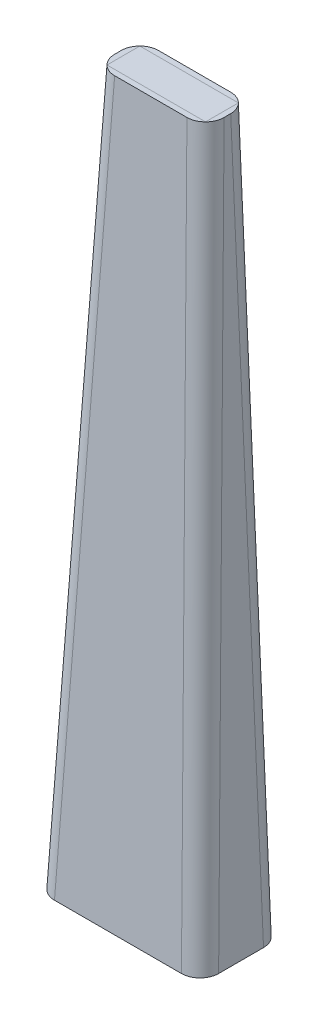
ISO-10303-21;
HEADER;
FILE_DESCRIPTION(('STEP AP214'),'2;1');
FILE_NAME('part.step','',(''),(''),'','','');
FILE_SCHEMA(('AUTOMOTIVE_DESIGN { 1 0 10303 214 1 1 1 1 }'));
ENDSEC;
DATA;
#1=APPLICATION_CONTEXT('core data for automotive mechanical design processes');
#2=APPLICATION_PROTOCOL_DEFINITION('international standard','automotive_design',2000,#1);
#3=PRODUCT_CONTEXT('',#1,'mechanical');
#4=PRODUCT('Part','Part','',(#3));
#5=PRODUCT_RELATED_PRODUCT_CATEGORY('part','',(#4));
#6=PRODUCT_DEFINITION_FORMATION('','',#4);
#7=PRODUCT_DEFINITION_CONTEXT('part definition',#1,'design');
#8=PRODUCT_DEFINITION('design','',#6,#7);
#9=PRODUCT_DEFINITION_SHAPE('','',#8);
#10=(LENGTH_UNIT() NAMED_UNIT(*) SI_UNIT(.MILLI.,.METRE.));
#11=(NAMED_UNIT(*) PLANE_ANGLE_UNIT() SI_UNIT($,.RADIAN.));
#12=(NAMED_UNIT(*) SI_UNIT($,.STERADIAN.) SOLID_ANGLE_UNIT());
#13=UNCERTAINTY_MEASURE_WITH_UNIT(LENGTH_MEASURE(1.E-05),#10,'distance_accuracy_value','');
#14=(GEOMETRIC_REPRESENTATION_CONTEXT(3) GLOBAL_UNCERTAINTY_ASSIGNED_CONTEXT((#13)) GLOBAL_UNIT_ASSIGNED_CONTEXT((#10,
#11,#12)) REPRESENTATION_CONTEXT('',''));
#15=CARTESIAN_POINT('',(0.,0.,0.));
#16=DIRECTION('',(0.,0.,1.));
#17=DIRECTION('',(1.,0.,0.));
#18=AXIS2_PLACEMENT_3D('',#15,#16,#17);
#19=CARTESIAN_POINT('',(-45.,640.,2.50000000000001));
#20=DIRECTION('',(0.,0.,1.));
#21=DIRECTION('',(1.,0.,0.));
#22=AXIS2_PLACEMENT_3D('',#19,#20,#21);
#23=PLANE('',#22);
#24=DIRECTION('',(1.,0.,0.));
#25=VECTOR('',#24,1.);
#26=CARTESIAN_POINT('',(-45.,650.,2.50000000000001));
#27=LINE('',#26,#25);
#28=CARTESIAN_POINT('',(-45.,650.,2.50000000000001));
#29=VERTEX_POINT('',#28);
#30=CARTESIAN_POINT('',(45.,650.,2.50000000000001));
#31=VERTEX_POINT('',#30);
#32=EDGE_CURVE('E256',#29,#31,#27,.T.);
#33=ORIENTED_EDGE('',*,*,#32,.F.);
#34=DIRECTION('',(0.,1.,0.));
#35=VECTOR('',#34,1.);
#36=CARTESIAN_POINT('',(-45.,640.,2.50000000000001));
#37=LINE('',#36,#35);
#38=CARTESIAN_POINT('',(-45.,640.,2.50000000000001));
#39=VERTEX_POINT('',#38);
#40=EDGE_CURVE('E14',#39,#29,#37,.T.);
#41=ORIENTED_EDGE('',*,*,#40,.F.);
#42=DIRECTION('',(1.,0.,0.));
#43=VECTOR('',#42,1.);
#44=CARTESIAN_POINT('',(-45.,640.,2.50000000000001));
#45=LINE('',#44,#43);
#46=CARTESIAN_POINT('',(45.,640.,2.50000000000001));
#47=VERTEX_POINT('',#46);
#48=EDGE_CURVE('E250',#39,#47,#45,.T.);
#49=ORIENTED_EDGE('',*,*,#48,.T.);
#50=DIRECTION('',(0.,1.,0.));
#51=VECTOR('',#50,1.);
#52=CARTESIAN_POINT('',(45.,640.,2.50000000000001));
#53=LINE('',#52,#51);
#54=EDGE_CURVE('E195',#47,#31,#53,.T.);
#55=ORIENTED_EDGE('',*,*,#54,.T.);
#56=EDGE_LOOP('',(#33,#41,#49,#55));
#57=FACE_BOUND('',#56,.T.);
#58=ADVANCED_FACE('F192',(#57),#23,.T.);
#59=CARTESIAN_POINT('',(-45.,640.,-27.5));
#60=DIRECTION('',(-1.,0.,0.));
#61=DIRECTION('',(0.,0.,1.));
#62=AXIS2_PLACEMENT_3D('',#59,#60,#61);
#63=PLANE('',#62);
#64=DIRECTION('',(0.,0.,1.));
#65=VECTOR('',#64,1.);
#66=CARTESIAN_POINT('',(-45.,650.,-27.5));
#67=LINE('',#66,#65);
#68=CARTESIAN_POINT('',(-45.,650.,-27.5));
#69=VERTEX_POINT('',#68);
#70=EDGE_CURVE('E252',#69,#29,#67,.T.);
#71=ORIENTED_EDGE('',*,*,#70,.F.);
#72=DIRECTION('',(0.,1.,0.));
#73=VECTOR('',#72,1.);
#74=CARTESIAN_POINT('',(-45.,640.,-27.5));
#75=LINE('',#74,#73);
#76=CARTESIAN_POINT('',(-45.,640.,-27.5));
#77=VERTEX_POINT('',#76);
#78=EDGE_CURVE('E201',#77,#69,#75,.T.);
#79=ORIENTED_EDGE('',*,*,#78,.F.);
#80=DIRECTION('',(0.,0.,1.));
#81=VECTOR('',#80,1.);
#82=CARTESIAN_POINT('',(-45.,640.,-27.5));
#83=LINE('',#82,#81);
#84=EDGE_CURVE('E247',#77,#39,#83,.T.);
#85=ORIENTED_EDGE('',*,*,#84,.T.);
#86=ORIENTED_EDGE('',*,*,#40,.T.);
#87=EDGE_LOOP('',(#71,#79,#85,#86));
#88=FACE_BOUND('',#87,.T.);
#89=ADVANCED_FACE('F266',(#88),#63,.T.);
#90=CARTESIAN_POINT('',(0.,640.,-27.5));
#91=DIRECTION('',(0.,0.,-1.));
#92=DIRECTION('',(-1.,0.,0.));
#93=AXIS2_PLACEMENT_3D('',#90,#91,#92);
#94=PLANE('',#93);
#95=DIRECTION('',(-1.,0.,0.));
#96=VECTOR('',#95,1.);
#97=CARTESIAN_POINT('',(0.,650.,-27.5));
#98=LINE('',#97,#96);
#99=CARTESIAN_POINT('',(45.,650.,-27.5));
#100=VERTEX_POINT('',#99);
#101=EDGE_CURVE('E241',#100,#69,#98,.T.);
#102=ORIENTED_EDGE('',*,*,#101,.F.);
#103=DIRECTION('',(0.,1.,0.));
#104=VECTOR('',#103,1.);
#105=CARTESIAN_POINT('',(45.,640.,-27.5));
#106=LINE('',#105,#104);
#107=CARTESIAN_POINT('',(45.,640.,-27.5));
#108=VERTEX_POINT('',#107);
#109=EDGE_CURVE('E237',#108,#100,#106,.T.);
#110=ORIENTED_EDGE('',*,*,#109,.F.);
#111=DIRECTION('',(-1.,0.,0.));
#112=VECTOR('',#111,1.);
#113=CARTESIAN_POINT('',(45.,640.,-27.5));
#114=LINE('',#113,#112);
#115=EDGE_CURVE('E240',#108,#77,#114,.T.);
#116=ORIENTED_EDGE('',*,*,#115,.T.);
#117=ORIENTED_EDGE('',*,*,#78,.T.);
#118=EDGE_LOOP('',(#102,#110,#116,#117));
#119=FACE_BOUND('',#118,.T.);
#120=ADVANCED_FACE('F239',(#119),#94,.T.);
#121=CARTESIAN_POINT('',(45.,640.,2.50000000000001));
#122=DIRECTION('',(1.,0.,0.));
#123=DIRECTION('',(0.,0.,-1.));
#124=AXIS2_PLACEMENT_3D('',#121,#122,#123);
#125=PLANE('',#124);
#126=DIRECTION('',(0.,0.,-1.));
#127=VECTOR('',#126,1.);
#128=CARTESIAN_POINT('',(45.,650.,2.50000000000001));
#129=LINE('',#128,#127);
#130=EDGE_CURVE('E259',#31,#100,#129,.T.);
#131=ORIENTED_EDGE('',*,*,#130,.F.);
#132=ORIENTED_EDGE('',*,*,#54,.F.);
#133=DIRECTION('',(0.,0.,-1.));
#134=VECTOR('',#133,1.);
#135=CARTESIAN_POINT('',(45.,640.,2.50000000000001));
#136=LINE('',#135,#134);
#137=EDGE_CURVE('E246',#47,#108,#136,.T.);
#138=ORIENTED_EDGE('',*,*,#137,.T.);
#139=ORIENTED_EDGE('',*,*,#109,.T.);
#140=EDGE_LOOP('',(#131,#132,#138,#139));
#141=FACE_BOUND('',#140,.T.);
#142=ADVANCED_FACE('F249',(#141),#125,.T.);
#143=CARTESIAN_POINT('',(0.,640.,0.));
#144=DIRECTION('',(0.,1.,0.));
#145=DIRECTION('',(0.,0.,1.));
#146=AXIS2_PLACEMENT_3D('',#143,#144,#145);
#147=PLANE('',#146);
#148=ORIENTED_EDGE('',*,*,#48,.F.);
#149=ORIENTED_EDGE('',*,*,#84,.F.);
#150=ORIENTED_EDGE('',*,*,#115,.F.);
#151=ORIENTED_EDGE('',*,*,#137,.F.);
#152=EDGE_LOOP('',(#148,#149,#150,#151));
#153=FACE_BOUND('',#152,.T.);
#154=ADVANCED_FACE('F245',(#153),#147,.F.);
#155=CARTESIAN_POINT('',(0.,650.,0.));
#156=DIRECTION('',(0.,1.,0.));
#157=DIRECTION('',(0.,0.,1.));
#158=AXIS2_PLACEMENT_3D('',#155,#156,#157);
#159=PLANE('',#158);
#160=ORIENTED_EDGE('',*,*,#32,.T.);
#161=ORIENTED_EDGE('',*,*,#130,.T.);
#162=ORIENTED_EDGE('',*,*,#101,.T.);
#163=ORIENTED_EDGE('',*,*,#70,.T.);
#164=EDGE_LOOP('',(#160,#161,#162,#163));
#165=FACE_BOUND('',#164,.T.);
#166=ADVANCED_FACE('F265',(#165),#159,.T.);
#167=CLOSED_SHELL('',(#58,#89,#120,#142,#154,#166));
#168=MANIFOLD_SOLID_BREP('B2',#167);
#169=CARTESIAN_POINT('',(-67.5,0.,-30.));
#170=DIRECTION('',(-0.999401425440469,0.0345946647267855,0.));
#171=DIRECTION('',(0.,0.,1.));
#172=AXIS2_PLACEMENT_3D('',#169,#170,#171);
#173=PLANE('',#172);
#174=DIRECTION('',(0.,0.,1.));
#175=VECTOR('',#174,1.);
#176=CARTESIAN_POINT('',(-67.1538461538462,10.,-30.));
#177=LINE('',#176,#175);
#178=CARTESIAN_POINT('',(-67.1538461538462,10.,-29.9615384615385));
#179=VERTEX_POINT('',#178);
#180=CARTESIAN_POINT('',(-67.1538461538462,10.,29.5769230769231));
#181=VERTEX_POINT('',#180);
#182=EDGE_CURVE('E426',#179,#181,#177,.T.);
#183=ORIENTED_EDGE('',*,*,#182,.F.);
#184=CARTESIAN_POINT('',(-67.5,0.,-30.));
#185=CARTESIAN_POINT('',(-60.,216.666666666667,-29.1666666666667));
#186=CARTESIAN_POINT('',(-52.5,433.333333333333,-28.3333333333333));
#187=CARTESIAN_POINT('',(-45.,650.,-27.5));
#188=B_SPLINE_CURVE_WITH_KNOTS('',3,(#184,#185,#186,#187),.UNSPECIFIED.,.F.,.F.,(4,4),(0.,1.),.UNSPECIFIED.);
#189=CARTESIAN_POINT('',(-45.,650.,-27.5));
#190=VERTEX_POINT('',#189);
#191=EDGE_CURVE('E450',#179,#190,#188,.T.);
#192=ORIENTED_EDGE('',*,*,#191,.T.);
#193=DIRECTION('',(0.,0.,1.));
#194=VECTOR('',#193,1.);
#195=CARTESIAN_POINT('',(-45.,650.,-27.5));
#196=LINE('',#195,#194);
#197=CARTESIAN_POINT('',(-45.,650.,2.50000000000001));
#198=VERTEX_POINT('',#197);
#199=EDGE_CURVE('E482',#190,#198,#196,.T.);
#200=ORIENTED_EDGE('',*,*,#199,.T.);
#201=CARTESIAN_POINT('',(-67.5,0.,30.));
#202=CARTESIAN_POINT('',(-60.,216.666666666667,20.8333333333333));
#203=CARTESIAN_POINT('',(-52.5,433.333333333333,11.6666666666667));
#204=CARTESIAN_POINT('',(-45.,650.,2.50000000000001));
#205=B_SPLINE_CURVE_WITH_KNOTS('',3,(#201,#202,#203,#204),.UNSPECIFIED.,.F.,.F.,(4,4),(0.,1.),.UNSPECIFIED.);
#206=EDGE_CURVE('E478',#181,#198,#205,.T.);
#207=ORIENTED_EDGE('',*,*,#206,.F.);
#208=EDGE_LOOP('',(#183,#192,#200,#207));
#209=FACE_BOUND('',#208,.T.);
#210=ADVANCED_FACE('F319',(#209),#173,.F.);
#211=CARTESIAN_POINT('',(67.5,0.,-30.));
#212=DIRECTION('',(0.,0.00384612539858595,-0.999992603632356));
#213=DIRECTION('',(-1.,0.,0.));
#214=AXIS2_PLACEMENT_3D('',#211,#212,#213);
#215=PLANE('',#214);
#216=DIRECTION('',(-1.,0.,0.));
#217=VECTOR('',#216,1.);
#218=CARTESIAN_POINT('',(67.5,10.,-29.9615384615384));
#219=LINE('',#218,#217);
#220=CARTESIAN_POINT('',(67.1538461538462,10.,-29.9615384615384));
#221=VERTEX_POINT('',#220);
#222=EDGE_CURVE('E434',#221,#179,#219,.T.);
#223=ORIENTED_EDGE('',*,*,#222,.F.);
#224=CARTESIAN_POINT('',(67.5,0.,-30.));
#225=CARTESIAN_POINT('',(60.,216.666666666667,-29.1666666666667));
#226=CARTESIAN_POINT('',(52.5,433.333333333333,-28.3333333333333));
#227=CARTESIAN_POINT('',(45.,650.,-27.5));
#228=B_SPLINE_CURVE_WITH_KNOTS('',3,(#224,#225,#226,#227),.UNSPECIFIED.,.F.,.F.,(4,4),(0.,1.),.UNSPECIFIED.);
#229=CARTESIAN_POINT('',(45.,650.,-27.5));
#230=VERTEX_POINT('',#229);
#231=EDGE_CURVE('E425',#221,#230,#228,.T.);
#232=ORIENTED_EDGE('',*,*,#231,.T.);
#233=DIRECTION('',(-1.,0.,0.));
#234=VECTOR('',#233,1.);
#235=CARTESIAN_POINT('',(45.,650.,-27.5));
#236=LINE('',#235,#234);
#237=EDGE_CURVE('E486',#230,#190,#236,.T.);
#238=ORIENTED_EDGE('',*,*,#237,.T.);
#239=ORIENTED_EDGE('',*,*,#191,.F.);
#240=EDGE_LOOP('',(#223,#232,#238,#239));
#241=FACE_BOUND('',#240,.T.);
#242=ADVANCED_FACE('F536',(#241),#215,.F.);
#243=CARTESIAN_POINT('',(67.5,0.,30.));
#244=DIRECTION('',(0.999401425440469,0.0345946647267855,0.));
#245=DIRECTION('',(0.,0.,-1.));
#246=AXIS2_PLACEMENT_3D('',#243,#244,#245);
#247=PLANE('',#246);
#248=DIRECTION('',(0.,0.,-1.));
#249=VECTOR('',#248,1.);
#250=CARTESIAN_POINT('',(67.1538461538462,10.,30.));
#251=LINE('',#250,#249);
#252=CARTESIAN_POINT('',(67.1538461538462,10.,29.5769230769231));
#253=VERTEX_POINT('',#252);
#254=EDGE_CURVE('E430',#253,#221,#251,.T.);
#255=ORIENTED_EDGE('',*,*,#254,.F.);
#256=CARTESIAN_POINT('',(67.5,0.,30.));
#257=CARTESIAN_POINT('',(60.,216.666666666667,20.8333333333334));
#258=CARTESIAN_POINT('',(52.5,433.333333333333,11.6666666666667));
#259=CARTESIAN_POINT('',(45.,650.,2.50000000000001));
#260=B_SPLINE_CURVE_WITH_KNOTS('',3,(#256,#257,#258,#259),.UNSPECIFIED.,.F.,.F.,(4,4),(0.,1.),.UNSPECIFIED.);
#261=CARTESIAN_POINT('',(45.,650.,2.50000000000001));
#262=VERTEX_POINT('',#261);
#263=EDGE_CURVE('E414',#253,#262,#260,.T.);
#264=ORIENTED_EDGE('',*,*,#263,.T.);
#265=DIRECTION('',(0.,0.,-1.));
#266=VECTOR('',#265,1.);
#267=CARTESIAN_POINT('',(45.,650.,2.50000000000001));
#268=LINE('',#267,#266);
#269=EDGE_CURVE('E491',#262,#230,#268,.T.);
#270=ORIENTED_EDGE('',*,*,#269,.T.);
#271=ORIENTED_EDGE('',*,*,#231,.F.);
#272=EDGE_LOOP('',(#255,#264,#270,#271));
#273=FACE_BOUND('',#272,.T.);
#274=ADVANCED_FACE('F431',(#273),#247,.F.);
#275=CARTESIAN_POINT('',(-67.5,0.,30.));
#276=DIRECTION('',(0.,0.0422698789300001,0.999106229254549));
#277=DIRECTION('',(1.,0.,0.));
#278=AXIS2_PLACEMENT_3D('',#275,#276,#277);
#279=PLANE('',#278);
#280=DIRECTION('',(1.,0.,0.));
#281=VECTOR('',#280,1.);
#282=CARTESIAN_POINT('',(-67.5,10.,29.5769230769231));
#283=LINE('',#282,#281);
#284=EDGE_CURVE('E418',#181,#253,#283,.T.);
#285=ORIENTED_EDGE('',*,*,#284,.F.);
#286=ORIENTED_EDGE('',*,*,#206,.T.);
#287=DIRECTION('',(1.,0.,0.));
#288=VECTOR('',#287,1.);
#289=CARTESIAN_POINT('',(-45.,650.,2.50000000000001));
#290=LINE('',#289,#288);
#291=EDGE_CURVE('E421',#198,#262,#290,.T.);
#292=ORIENTED_EDGE('',*,*,#291,.T.);
#293=ORIENTED_EDGE('',*,*,#263,.F.);
#294=EDGE_LOOP('',(#285,#286,#292,#293));
#295=FACE_BOUND('',#294,.T.);
#296=ADVANCED_FACE('F416',(#295),#279,.F.);
#297=CARTESIAN_POINT('',(0.,650.,0.));
#298=DIRECTION('',(0.,1.,0.));
#299=DIRECTION('',(0.,0.,1.));
#300=AXIS2_PLACEMENT_3D('',#297,#298,#299);
#301=PLANE('',#300);
#302=ORIENTED_EDGE('',*,*,#199,.F.);
#303=ORIENTED_EDGE('',*,*,#237,.F.);
#304=ORIENTED_EDGE('',*,*,#269,.F.);
#305=ORIENTED_EDGE('',*,*,#291,.F.);
#306=EDGE_LOOP('',(#302,#303,#304,#305));
#307=FACE_BOUND('',#306,.T.);
#308=DIRECTION('',(1.,0.,0.));
#309=VECTOR('',#308,1.);
#310=CARTESIAN_POINT('',(-50.,650.,7.50000000000001));
#311=LINE('',#310,#309);
#312=CARTESIAN_POINT('',(-33.0175761065224,650.,7.50000000000001));
#313=VERTEX_POINT('',#312);
#314=CARTESIAN_POINT('',(33.0175761065224,650.,7.50000000000001));
#315=VERTEX_POINT('',#314);
#316=EDGE_CURVE('E619',#313,#315,#311,.T.);
#317=ORIENTED_EDGE('',*,*,#316,.T.);
#318=CARTESIAN_POINT('',(32.9874306822015,650.,-9.51809687661271));
#319=DIRECTION('',(0.,1.,0.));
#320=DIRECTION('',(-0.64018439966448,0.,-0.768221279597376));
#321=AXIS2_PLACEMENT_3D('',#318,#319,#320);
#322=ELLIPSE('',#321,17.0306528381819,17.);
#323=CARTESIAN_POINT('',(50.,650.,-9.48794165773331));
#324=VERTEX_POINT('',#323);
#325=EDGE_CURVE('E736',#315,#324,#322,.T.);
#326=ORIENTED_EDGE('',*,*,#325,.T.);
#327=DIRECTION('',(0.,0.,-1.));
#328=VECTOR('',#327,1.);
#329=CARTESIAN_POINT('',(50.,650.,7.50000000000001));
#330=LINE('',#329,#328);
#331=CARTESIAN_POINT('',(50.,650.,-15.5045229186733));
#332=VERTEX_POINT('',#331);
#333=EDGE_CURVE('E443',#324,#332,#330,.T.);
#334=ORIENTED_EDGE('',*,*,#333,.T.);
#335=CARTESIAN_POINT('',(32.9874306822015,650.,-15.4994970488601));
#336=DIRECTION('',(0.,1.,0.));
#337=DIRECTION('',(-0.98058067569092,0.,0.196116135138184));
#338=AXIS2_PLACEMENT_3D('',#335,#336,#337);
#339=ELLIPSE('',#338,17.0130718973563,17.);
#340=CARTESIAN_POINT('',(32.9924601192026,650.,-32.5));
#341=VERTEX_POINT('',#340);
#342=EDGE_CURVE('E653',#332,#341,#339,.T.);
#343=ORIENTED_EDGE('',*,*,#342,.T.);
#344=DIRECTION('',(-1.,0.,0.));
#345=VECTOR('',#344,1.);
#346=CARTESIAN_POINT('',(0.,650.,-32.5));
#347=LINE('',#346,#345);
#348=CARTESIAN_POINT('',(0.,650.,-32.5));
#349=VERTEX_POINT('',#348);
#350=EDGE_CURVE('E439',#341,#349,#347,.T.);
#351=ORIENTED_EDGE('',*,*,#350,.T.);
#352=DIRECTION('',(-1.,0.,0.));
#353=VECTOR('',#352,1.);
#354=CARTESIAN_POINT('',(0.,650.,-32.5));
#355=LINE('',#354,#353);
#356=CARTESIAN_POINT('',(-32.9924601192026,650.,-32.5));
#357=VERTEX_POINT('',#356);
#358=EDGE_CURVE('E672',#349,#357,#355,.T.);
#359=ORIENTED_EDGE('',*,*,#358,.T.);
#360=CARTESIAN_POINT('',(-32.9874306822015,650.,-15.4994970488601));
#361=DIRECTION('',(0.,1.,0.));
#362=DIRECTION('',(0.98058067569092,0.,0.196116135138184));
#363=AXIS2_PLACEMENT_3D('',#360,#361,#362);
#364=ELLIPSE('',#363,17.0130718973563,17.);
#365=CARTESIAN_POINT('',(-50.,650.,-15.5045229186733));
#366=VERTEX_POINT('',#365);
#367=EDGE_CURVE('E728',#357,#366,#364,.T.);
#368=ORIENTED_EDGE('',*,*,#367,.T.);
#369=DIRECTION('',(0.,0.,1.));
#370=VECTOR('',#369,1.);
#371=CARTESIAN_POINT('',(-50.,650.,-32.5));
#372=LINE('',#371,#370);
#373=CARTESIAN_POINT('',(-50.,650.,-9.4879416577333));
#374=VERTEX_POINT('',#373);
#375=EDGE_CURVE('E623',#366,#374,#372,.T.);
#376=ORIENTED_EDGE('',*,*,#375,.T.);
#377=CARTESIAN_POINT('',(-32.9874306822015,650.,-9.5180968766127));
#378=DIRECTION('',(0.,1.,0.));
#379=DIRECTION('',(0.640184399664479,0.,-0.768221279597376));
#380=AXIS2_PLACEMENT_3D('',#377,#378,#379);
#381=ELLIPSE('',#380,17.0306528381819,17.);
#382=EDGE_CURVE('E732',#374,#313,#381,.T.);
#383=ORIENTED_EDGE('',*,*,#382,.T.);
#384=EDGE_LOOP('',(#317,#326,#334,#343,#351,#359,#368,#376,#383));
#385=FACE_BOUND('',#384,.T.);
#386=ADVANCED_FACE('F550',(#307,#385),#301,.T.);
#387=CARTESIAN_POINT('',(0.,0.,0.));
#388=DIRECTION('',(0.,1.,0.));
#389=DIRECTION('',(0.,0.,1.));
#390=AXIS2_PLACEMENT_3D('',#387,#388,#389);
#391=PLANE('',#390);
#392=DIRECTION('',(0.,0.,-1.));
#393=VECTOR('',#392,1.);
#394=CARTESIAN_POINT('',(75.,0.,37.5));
#395=LINE('',#394,#393);
#396=CARTESIAN_POINT('',(75.,0.,20.5120583422667));
#397=VERTEX_POINT('',#396);
#398=CARTESIAN_POINT('',(75.,0.,-20.5045229186733));
#399=VERTEX_POINT('',#398);
#400=EDGE_CURVE('E323',#397,#399,#395,.T.);
#401=ORIENTED_EDGE('',*,*,#400,.F.);
#402=CARTESIAN_POINT('',(57.9874306822015,0.,20.4819031233873));
#403=DIRECTION('',(0.,1.,0.));
#404=DIRECTION('',(-0.64018439966448,0.,-0.768221279597376));
#405=AXIS2_PLACEMENT_3D('',#402,#403,#404);
#406=ELLIPSE('',#405,17.0306528381819,17.);
#407=CARTESIAN_POINT('',(58.0175761065224,0.,37.5));
#408=VERTEX_POINT('',#407);
#409=EDGE_CURVE('E599',#397,#408,#406,.F.);
#410=ORIENTED_EDGE('',*,*,#409,.T.);
#411=DIRECTION('',(1.,0.,0.));
#412=VECTOR('',#411,1.);
#413=CARTESIAN_POINT('',(75.,0.,37.5));
#414=LINE('',#413,#412);
#415=CARTESIAN_POINT('',(-58.0175761065224,0.,37.5));
#416=VERTEX_POINT('',#415);
#417=EDGE_CURVE('E624',#416,#408,#414,.T.);
#418=ORIENTED_EDGE('',*,*,#417,.F.);
#419=CARTESIAN_POINT('',(-57.9874306822015,0.,20.4819031233873));
#420=DIRECTION('',(0.,1.,0.));
#421=DIRECTION('',(0.640184399664479,0.,-0.768221279597376));
#422=AXIS2_PLACEMENT_3D('',#419,#420,#421);
#423=ELLIPSE('',#422,17.0306528381819,17.);
#424=CARTESIAN_POINT('',(-75.,0.,20.5120583422667));
#425=VERTEX_POINT('',#424);
#426=EDGE_CURVE('E595',#416,#425,#423,.F.);
#427=ORIENTED_EDGE('',*,*,#426,.T.);
#428=DIRECTION('',(0.,0.,1.));
#429=VECTOR('',#428,1.);
#430=CARTESIAN_POINT('',(-75.,0.,37.5));
#431=LINE('',#430,#429);
#432=CARTESIAN_POINT('',(-75.,0.,-20.5045229186733));
#433=VERTEX_POINT('',#432);
#434=EDGE_CURVE('E485',#433,#425,#431,.T.);
#435=ORIENTED_EDGE('',*,*,#434,.F.);
#436=CARTESIAN_POINT('',(-57.9874306822015,0.,-20.4994970488601));
#437=DIRECTION('',(0.,1.,0.));
#438=DIRECTION('',(0.98058067569092,0.,0.196116135138184));
#439=AXIS2_PLACEMENT_3D('',#436,#437,#438);
#440=ELLIPSE('',#439,17.0130718973563,17.);
#441=CARTESIAN_POINT('',(-57.9924601192026,0.,-37.5));
#442=VERTEX_POINT('',#441);
#443=EDGE_CURVE('E337',#433,#442,#440,.F.);
#444=ORIENTED_EDGE('',*,*,#443,.T.);
#445=DIRECTION('',(-1.,0.,0.));
#446=VECTOR('',#445,1.);
#447=CARTESIAN_POINT('',(75.,0.,-37.5));
#448=LINE('',#447,#446);
#449=CARTESIAN_POINT('',(57.9924601192026,0.,-37.5));
#450=VERTEX_POINT('',#449);
#451=EDGE_CURVE('E585',#450,#442,#448,.T.);
#452=ORIENTED_EDGE('',*,*,#451,.F.);
#453=CARTESIAN_POINT('',(57.9874306822015,0.,-20.4994970488601));
#454=DIRECTION('',(0.,1.,0.));
#455=DIRECTION('',(-0.98058067569092,0.,0.196116135138184));
#456=AXIS2_PLACEMENT_3D('',#453,#454,#455);
#457=ELLIPSE('',#456,17.0130718973563,17.);
#458=EDGE_CURVE('E589',#450,#399,#457,.F.);
#459=ORIENTED_EDGE('',*,*,#458,.T.);
#460=EDGE_LOOP('',(#401,#410,#418,#427,#435,#444,#452,#459));
#461=FACE_BOUND('',#460,.T.);
#462=ADVANCED_FACE('F551',(#461),#391,.F.);
#463=CARTESIAN_POINT('',(-75.,0.,-37.5));
#464=DIRECTION('',(-0.999261174631314,0.0384331221012044,0.));
#465=DIRECTION('',(0.,0.,1.));
#466=AXIS2_PLACEMENT_3D('',#463,#464,#465);
#467=PLANE('',#466);
#468=ORIENTED_EDGE('',*,*,#434,.T.);
#469=DIRECTION('',(0.0383923129699562,0.998200137218861,-0.0460707755639474));
#470=VECTOR('',#469,1.);
#471=CARTESIAN_POINT('',(-74.897390380858,2.66785009769283,20.3889267992963));
#472=LINE('',#471,#470);
#473=EDGE_CURVE('E607',#425,#374,#472,.T.);
#474=ORIENTED_EDGE('',*,*,#473,.T.);
#475=ORIENTED_EDGE('',*,*,#375,.F.);
#476=DIRECTION('',(0.0384319867564749,0.999231655668348,0.00768639735129497));
#477=VECTOR('',#476,1.);
#478=CARTESIAN_POINT('',(-75.0050205237744,-0.130533618136149,-20.5055270234282));
#479=LINE('',#478,#477);
#480=EDGE_CURVE('E603',#366,#433,#479,.F.);
#481=ORIENTED_EDGE('',*,*,#480,.T.);
#482=EDGE_LOOP('',(#468,#474,#475,#481));
#483=FACE_BOUND('',#482,.T.);
#484=ADVANCED_FACE('F555',(#483),#467,.T.);
#485=CARTESIAN_POINT('',(75.,0.,-37.5));
#486=DIRECTION('',(0.,0.0076920801193392,-0.999970415514098));
#487=DIRECTION('',(-1.,0.,0.));
#488=AXIS2_PLACEMENT_3D('',#485,#486,#487);
#489=PLANE('',#488);
#490=ORIENTED_EDGE('',*,*,#451,.T.);
#491=DIRECTION('',(0.0384319867564749,0.999231655668348,0.00768639735129497));
#492=VECTOR('',#491,1.);
#493=CARTESIAN_POINT('',(-57.7960279141347,5.10723733176661,-37.4607135589864));
#494=LINE('',#493,#492);
#495=EDGE_CURVE('E190',#442,#357,#494,.T.);
#496=ORIENTED_EDGE('',*,*,#495,.T.);
#497=ORIENTED_EDGE('',*,*,#358,.F.);
#498=ORIENTED_EDGE('',*,*,#350,.F.);
#499=DIRECTION('',(-0.0384319867564749,0.999231655668348,0.00768639735129498));
#500=VECTOR('',#499,1.);
#501=CARTESIAN_POINT('',(58.0175805550421,-0.653131331827857,-37.5050240871679));
#502=LINE('',#501,#500);
#503=EDGE_CURVE('E329',#341,#450,#502,.F.);
#504=ORIENTED_EDGE('',*,*,#503,.T.);
#505=EDGE_LOOP('',(#490,#496,#497,#498,#504));
#506=FACE_BOUND('',#505,.T.);
#507=ADVANCED_FACE('F693',(#506),#489,.T.);
#508=CARTESIAN_POINT('',(75.,0.,37.5));
#509=DIRECTION('',(0.999261174631314,0.0384331221012044,0.));
#510=DIRECTION('',(0.,0.,-1.));
#511=AXIS2_PLACEMENT_3D('',#508,#509,#510);
#512=PLANE('',#511);
#513=ORIENTED_EDGE('',*,*,#333,.F.);
#514=DIRECTION('',(-0.0383923129699562,0.998200137218861,-0.0460707755639474));
#515=VECTOR('',#514,1.);
#516=CARTESIAN_POINT('',(75.0300476534245,-0.781238989035551,20.548115526376));
#517=LINE('',#516,#515);
#518=EDGE_CURVE('E591',#324,#397,#517,.F.);
#519=ORIENTED_EDGE('',*,*,#518,.T.);
#520=ORIENTED_EDGE('',*,*,#400,.T.);
#521=DIRECTION('',(-0.0384319867564749,0.999231655668348,0.00768639735129498));
#522=VECTOR('',#521,1.);
#523=CARTESIAN_POINT('',(74.9828652596837,0.445503248223297,-20.5010959706101));
#524=LINE('',#523,#522);
#525=EDGE_CURVE('E740',#399,#332,#524,.T.);
#526=ORIENTED_EDGE('',*,*,#525,.T.);
#527=EDGE_LOOP('',(#513,#519,#520,#526));
#528=FACE_BOUND('',#527,.T.);
#529=ADVANCED_FACE('F516',(#528),#512,.T.);
#530=CARTESIAN_POINT('',(-75.,0.,37.5));
#531=DIRECTION('',(0.,0.0461047666084009,0.998936609848686));
#532=DIRECTION('',(1.,0.,0.));
#533=AXIS2_PLACEMENT_3D('',#530,#531,#532);
#534=PLANE('',#533);
#535=ORIENTED_EDGE('',*,*,#417,.T.);
#536=DIRECTION('',(-0.0383923129699562,0.998200137218861,-0.0460707755639474));
#537=VECTOR('',#536,1.);
#538=CARTESIAN_POINT('',(57.8215122304147,5.09766077880075,37.2647233486707));
#539=LINE('',#538,#537);
#540=EDGE_CURVE('E441',#408,#315,#539,.T.);
#541=ORIENTED_EDGE('',*,*,#540,.T.);
#542=ORIENTED_EDGE('',*,*,#316,.F.);
#543=DIRECTION('',(0.0383923129699562,0.998200137218861,-0.0460707755639474));
#544=VECTOR('',#543,1.);
#545=CARTESIAN_POINT('',(-58.0426076846921,-0.65082103241321,37.5300378938037));
#546=LINE('',#545,#544);
#547=EDGE_CURVE('E438',#313,#416,#546,.F.);
#548=ORIENTED_EDGE('',*,*,#547,.T.);
#549=EDGE_LOOP('',(#535,#541,#542,#548));
#550=FACE_BOUND('',#549,.T.);
#551=ADVANCED_FACE('F506',(#550),#534,.T.);
#552=CARTESIAN_POINT('',(0.,10.,0.));
#553=DIRECTION('',(0.,-1.,0.));
#554=DIRECTION('',(0.,0.,-1.));
#555=AXIS2_PLACEMENT_3D('',#552,#553,#554);
#556=PLANE('',#555);
#557=ORIENTED_EDGE('',*,*,#222,.T.);
#558=ORIENTED_EDGE('',*,*,#182,.T.);
#559=ORIENTED_EDGE('',*,*,#284,.T.);
#560=ORIENTED_EDGE('',*,*,#254,.T.);
#561=EDGE_LOOP('',(#557,#558,#559,#560));
#562=FACE_BOUND('',#561,.T.);
#563=ADVANCED_FACE('F437',(#562),#556,.F.);
#564=CARTESIAN_POINT('',(57.8215122304147,4.31387974645794,20.2828009812431));
#565=DIRECTION('',(-0.0383923129699562,0.998200137218861,-0.0460707755639474));
#566=DIRECTION('',(0.,0.0461047666084009,0.998936609848685));
#567=AXIS2_PLACEMENT_3D('',#564,#565,#566);
#568=CYLINDRICAL_SURFACE('',#567,17.);
#569=ORIENTED_EDGE('',*,*,#409,.F.);
#570=ORIENTED_EDGE('',*,*,#518,.F.);
#571=ORIENTED_EDGE('',*,*,#325,.F.);
#572=ORIENTED_EDGE('',*,*,#540,.F.);
#573=EDGE_LOOP('',(#569,#570,#571,#572));
#574=FACE_BOUND('',#573,.T.);
#575=ADVANCED_FACE('F520',(#574),#568,.T.);
#576=CARTESIAN_POINT('',(-57.9099504121256,2.01448702197235,20.3889267992963));
#577=DIRECTION('',(0.0383923129699562,0.998200137218861,-0.0460707755639474));
#578=DIRECTION('',(0.,0.0461047666084009,0.998936609848685));
#579=AXIS2_PLACEMENT_3D('',#576,#577,#578);
#580=CYLINDRICAL_SURFACE('',#579,17.);
#581=ORIENTED_EDGE('',*,*,#426,.F.);
#582=ORIENTED_EDGE('',*,*,#547,.F.);
#583=ORIENTED_EDGE('',*,*,#382,.F.);
#584=ORIENTED_EDGE('',*,*,#473,.F.);
#585=EDGE_LOOP('',(#581,#582,#583,#584));
#586=FACE_BOUND('',#585,.T.);
#587=ADVANCED_FACE('F524',(#586),#580,.T.);
#588=CARTESIAN_POINT('',(-57.7960279141347,4.97647196973784,-20.4612164952467));
#589=DIRECTION('',(0.0384319867564749,0.999231655668348,0.00768639735129497));
#590=DIRECTION('',(-0.999261174631314,0.0384331221012044,0.));
#591=AXIS2_PLACEMENT_3D('',#588,#589,#590);
#592=CYLINDRICAL_SURFACE('',#591,17.);
#593=ORIENTED_EDGE('',*,*,#443,.F.);
#594=ORIENTED_EDGE('',*,*,#480,.F.);
#595=ORIENTED_EDGE('',*,*,#367,.F.);
#596=ORIENTED_EDGE('',*,*,#495,.F.);
#597=EDGE_LOOP('',(#593,#594,#595,#596));
#598=FACE_BOUND('',#597,.T.);
#599=ADVANCED_FACE('F527',(#598),#592,.T.);
#600=CARTESIAN_POINT('',(57.9954252909514,-0.207859827497178,-20.5010959706101));
#601=DIRECTION('',(-0.0384319867564749,0.999231655668348,0.00768639735129498));
#602=DIRECTION('',(-0.999261174631314,-0.0384331221012044,0.));
#603=AXIS2_PLACEMENT_3D('',#600,#601,#602);
#604=CYLINDRICAL_SURFACE('',#603,17.);
#605=ORIENTED_EDGE('',*,*,#458,.F.);
#606=ORIENTED_EDGE('',*,*,#503,.F.);
#607=ORIENTED_EDGE('',*,*,#342,.F.);
#608=ORIENTED_EDGE('',*,*,#525,.F.);
#609=EDGE_LOOP('',(#605,#606,#607,#608));
#610=FACE_BOUND('',#609,.T.);
#611=ADVANCED_FACE('F321',(#610),#604,.T.);
#612=CLOSED_SHELL('',(#210,#242,#274,#296,#386,#462,#484,#507,#529,#551,#563,#575,#587,#599,#611));
#613=MANIFOLD_SOLID_BREP('B8',#612);
#614=ADVANCED_BREP_SHAPE_REPRESENTATION('',(#18,#168,#613),#14);
#615=SHAPE_DEFINITION_REPRESENTATION(#9,#614);
ENDSEC;
END-ISO-10303-21;
